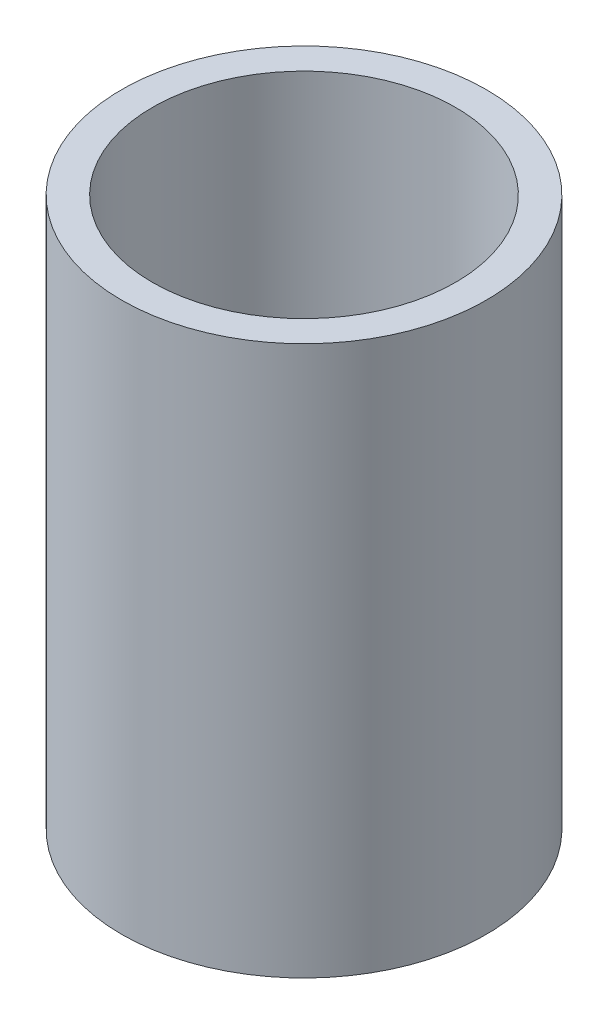
ISO-10303-21;
HEADER;
FILE_DESCRIPTION(('STEP AP214'),'2;1');
FILE_NAME('part.step','',(''),(''),'','','');
FILE_SCHEMA(('AUTOMOTIVE_DESIGN { 1 0 10303 214 1 1 1 1 }'));
ENDSEC;
DATA;
#1=APPLICATION_CONTEXT('core data for automotive mechanical design processes');
#2=APPLICATION_PROTOCOL_DEFINITION('international standard','automotive_design',2000,#1);
#3=PRODUCT_CONTEXT('',#1,'mechanical');
#4=PRODUCT('Part','Part','',(#3));
#5=PRODUCT_RELATED_PRODUCT_CATEGORY('part','',(#4));
#6=PRODUCT_DEFINITION_FORMATION('','',#4);
#7=PRODUCT_DEFINITION_CONTEXT('part definition',#1,'design');
#8=PRODUCT_DEFINITION('design','',#6,#7);
#9=PRODUCT_DEFINITION_SHAPE('','',#8);
#10=(LENGTH_UNIT() NAMED_UNIT(*) SI_UNIT(.MILLI.,.METRE.));
#11=(NAMED_UNIT(*) PLANE_ANGLE_UNIT() SI_UNIT($,.RADIAN.));
#12=(NAMED_UNIT(*) SI_UNIT($,.STERADIAN.) SOLID_ANGLE_UNIT());
#13=UNCERTAINTY_MEASURE_WITH_UNIT(LENGTH_MEASURE(1.E-05),#10,'distance_accuracy_value','');
#14=(GEOMETRIC_REPRESENTATION_CONTEXT(3) GLOBAL_UNCERTAINTY_ASSIGNED_CONTEXT((#13)) GLOBAL_UNIT_ASSIGNED_CONTEXT((#10,
#11,#12)) REPRESENTATION_CONTEXT('',''));
#15=CARTESIAN_POINT('',(0.,0.,0.));
#16=DIRECTION('',(0.,0.,1.));
#17=DIRECTION('',(1.,0.,0.));
#18=AXIS2_PLACEMENT_3D('',#15,#16,#17);
#19=CARTESIAN_POINT('',(0.,-31.75,0.));
#20=DIRECTION('',(0.,1.,0.));
#21=DIRECTION('',(0.,0.,1.));
#22=AXIS2_PLACEMENT_3D('',#19,#20,#21);
#23=CYLINDRICAL_SURFACE('',#22,17.526);
#24=CARTESIAN_POINT('',(0.,31.75,0.));
#25=DIRECTION('',(0.,1.,0.));
#26=DIRECTION('',(0.,0.,1.));
#27=AXIS2_PLACEMENT_3D('',#24,#25,#26);
#28=CIRCLE('',#27,17.526);
#29=CARTESIAN_POINT('',(0.,31.75,17.526));
#30=VERTEX_POINT('',#29);
#31=EDGE_CURVE('E18',#30,#30,#28,.F.);
#32=ORIENTED_EDGE('',*,*,#31,.F.);
#33=EDGE_LOOP('',(#32));
#34=FACE_BOUND('',#33,.T.);
#35=CARTESIAN_POINT('',(0.,-31.75,0.));
#36=DIRECTION('',(0.,1.,0.));
#37=DIRECTION('',(0.,0.,1.));
#38=AXIS2_PLACEMENT_3D('',#35,#36,#37);
#39=CIRCLE('',#38,17.526);
#40=CARTESIAN_POINT('',(0.,-31.75,17.526));
#41=VERTEX_POINT('',#40);
#42=EDGE_CURVE('E27',#41,#41,#39,.F.);
#43=ORIENTED_EDGE('',*,*,#42,.T.);
#44=EDGE_LOOP('',(#43));
#45=FACE_BOUND('',#44,.T.);
#46=ADVANCED_FACE('F15',(#34,#45),#23,.F.);
#47=CARTESIAN_POINT('',(0.,31.75,0.));
#48=DIRECTION('',(0.,1.,0.));
#49=DIRECTION('',(0.,0.,1.));
#50=AXIS2_PLACEMENT_3D('',#47,#48,#49);
#51=PLANE('',#50);
#52=ORIENTED_EDGE('',*,*,#31,.T.);
#53=EDGE_LOOP('',(#52));
#54=FACE_BOUND('',#53,.T.);
#55=CARTESIAN_POINT('',(0.,31.75,0.));
#56=DIRECTION('',(0.,1.,0.));
#57=DIRECTION('',(0.,0.,1.));
#58=AXIS2_PLACEMENT_3D('',#55,#56,#57);
#59=CIRCLE('',#58,21.082);
#60=CARTESIAN_POINT('',(0.,31.75,21.082));
#61=VERTEX_POINT('',#60);
#62=EDGE_CURVE('E22',#61,#61,#59,.F.);
#63=ORIENTED_EDGE('',*,*,#62,.F.);
#64=EDGE_LOOP('',(#63));
#65=FACE_BOUND('',#64,.T.);
#66=ADVANCED_FACE('F35',(#54,#65),#51,.T.);
#67=CARTESIAN_POINT('',(0.,-31.75,0.));
#68=DIRECTION('',(0.,1.,0.));
#69=DIRECTION('',(0.,0.,1.));
#70=AXIS2_PLACEMENT_3D('',#67,#68,#69);
#71=PLANE('',#70);
#72=ORIENTED_EDGE('',*,*,#42,.F.);
#73=EDGE_LOOP('',(#72));
#74=FACE_BOUND('',#73,.T.);
#75=CARTESIAN_POINT('',(0.,-31.75,0.));
#76=DIRECTION('',(0.,1.,0.));
#77=DIRECTION('',(0.,0.,1.));
#78=AXIS2_PLACEMENT_3D('',#75,#76,#77);
#79=CIRCLE('',#78,21.082);
#80=CARTESIAN_POINT('',(0.,-31.75,21.082));
#81=VERTEX_POINT('',#80);
#82=EDGE_CURVE('E10',#81,#81,#79,.T.);
#83=ORIENTED_EDGE('',*,*,#82,.F.);
#84=EDGE_LOOP('',(#83));
#85=FACE_BOUND('',#84,.T.);
#86=ADVANCED_FACE('F43',(#74,#85),#71,.F.);
#87=CARTESIAN_POINT('',(0.,-31.75,0.));
#88=DIRECTION('',(0.,1.,0.));
#89=DIRECTION('',(0.,0.,1.));
#90=AXIS2_PLACEMENT_3D('',#87,#88,#89);
#91=CYLINDRICAL_SURFACE('',#90,21.082);
#92=ORIENTED_EDGE('',*,*,#62,.T.);
#93=EDGE_LOOP('',(#92));
#94=FACE_BOUND('',#93,.T.);
#95=ORIENTED_EDGE('',*,*,#82,.T.);
#96=EDGE_LOOP('',(#95));
#97=FACE_BOUND('',#96,.T.);
#98=ADVANCED_FACE('F44',(#94,#97),#91,.T.);
#99=CLOSED_SHELL('',(#46,#66,#86,#98));
#100=MANIFOLD_SOLID_BREP('B1',#99);
#101=ADVANCED_BREP_SHAPE_REPRESENTATION('',(#18,#100),#14);
#102=SHAPE_DEFINITION_REPRESENTATION(#9,#101);
ENDSEC;
END-ISO-10303-21;
